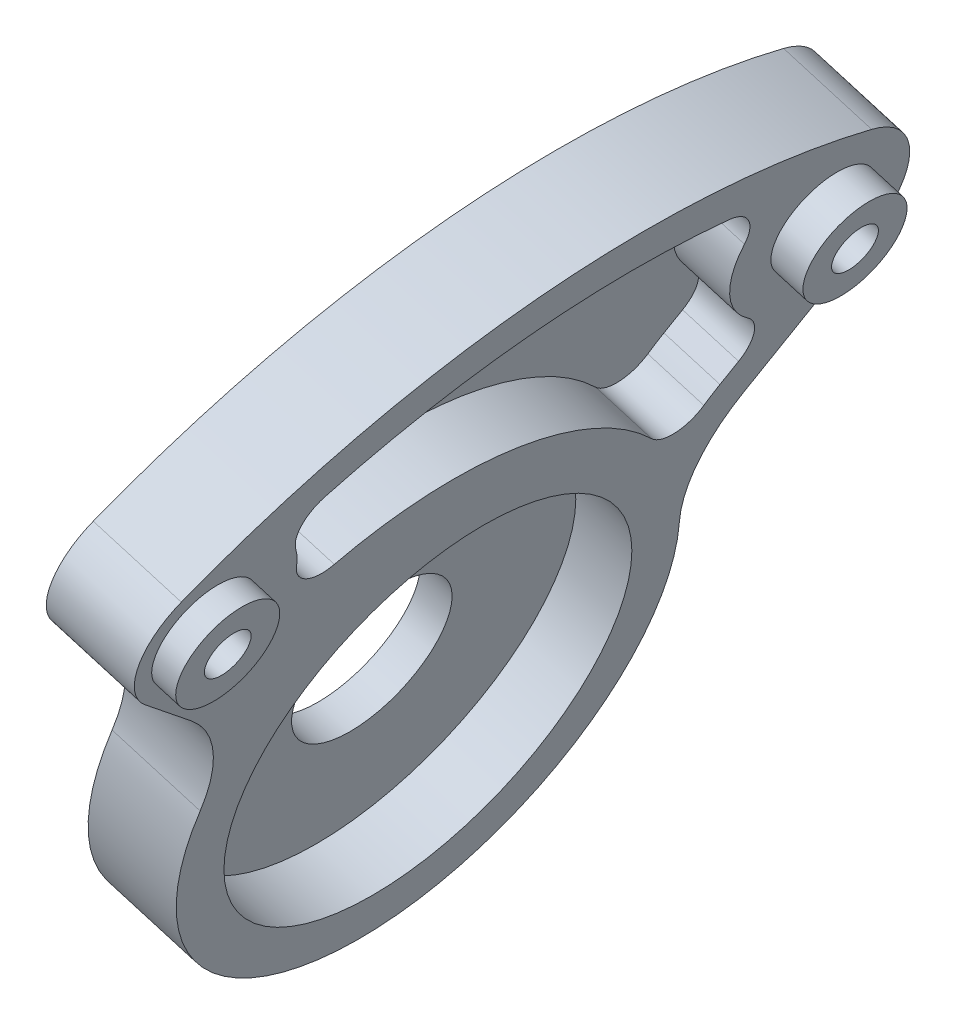
ISO-10303-21;
HEADER;
FILE_DESCRIPTION(('STEP AP214'),'2;1');
FILE_NAME('part.step','',(''),(''),'','','');
FILE_SCHEMA(('AUTOMOTIVE_DESIGN { 1 0 10303 214 1 1 1 1 }'));
ENDSEC;
DATA;
#1=APPLICATION_CONTEXT('core data for automotive mechanical design processes');
#2=APPLICATION_PROTOCOL_DEFINITION('international standard','automotive_design',2000,#1);
#3=PRODUCT_CONTEXT('',#1,'mechanical');
#4=PRODUCT('Part','Part','',(#3));
#5=PRODUCT_RELATED_PRODUCT_CATEGORY('part','',(#4));
#6=PRODUCT_DEFINITION_FORMATION('','',#4);
#7=PRODUCT_DEFINITION_CONTEXT('part definition',#1,'design');
#8=PRODUCT_DEFINITION('design','',#6,#7);
#9=PRODUCT_DEFINITION_SHAPE('','',#8);
#10=(LENGTH_UNIT() NAMED_UNIT(*) SI_UNIT(.MILLI.,.METRE.));
#11=(NAMED_UNIT(*) PLANE_ANGLE_UNIT() SI_UNIT($,.RADIAN.));
#12=(NAMED_UNIT(*) SI_UNIT($,.STERADIAN.) SOLID_ANGLE_UNIT());
#13=UNCERTAINTY_MEASURE_WITH_UNIT(LENGTH_MEASURE(1.E-05),#10,'distance_accuracy_value','');
#14=(GEOMETRIC_REPRESENTATION_CONTEXT(3) GLOBAL_UNCERTAINTY_ASSIGNED_CONTEXT((#13)) GLOBAL_UNIT_ASSIGNED_CONTEXT((#10,
#11,#12)) REPRESENTATION_CONTEXT('',''));
#15=CARTESIAN_POINT('',(0.,0.,0.));
#16=DIRECTION('',(0.,0.,1.));
#17=DIRECTION('',(1.,0.,0.));
#18=AXIS2_PLACEMENT_3D('',#15,#16,#17);
#19=CARTESIAN_POINT('',(75.6929175466582,-3.76179656158974,66.7343959904241));
#20=DIRECTION('',(0.958965274023996,-0.283523549667541,0.));
#21=DIRECTION('',(0.283523549667541,0.958965274023996,0.));
#22=AXIS2_PLACEMENT_3D('',#19,#20,#21);
#23=PLANE('',#22);
#24=CARTESIAN_POINT('',(75.6929175466582,-3.76179656158974,66.7343959904241));
#25=DIRECTION('',(0.958965274023996,-0.283523549667541,0.));
#26=DIRECTION('',(0.283523549667541,0.958965274023996,0.));
#27=AXIS2_PLACEMENT_3D('',#24,#25,#26);
#28=CIRCLE('',#27,8.00000000000008);
#29=CARTESIAN_POINT('',(77.199374063639,1.33351029495058,72.7150679259294));
#30=VERTEX_POINT('',#29);
#31=CARTESIAN_POINT('',(75.1793258350481,-5.49892427827565,74.5266107493798));
#32=VERTEX_POINT('',#31);
#33=EDGE_CURVE('E168',#30,#32,#28,.T.);
#34=ORIENTED_EDGE('',*,*,#33,.F.);
#35=DIRECTION('',(-0.211957667068936,-0.716907087684927,0.664167279379081));
#36=VECTOR('',#35,1.);
#37=CARTESIAN_POINT('',(79.029762545503,7.52445631738643,66.9795634970611));
#38=LINE('',#37,#36);
#39=CARTESIAN_POINT('',(79.029762545503,7.52445631738643,66.9795634970611));
#40=VERTEX_POINT('',#39);
#41=EDGE_CURVE('E137',#40,#30,#38,.T.);
#42=ORIENTED_EDGE('',*,*,#41,.F.);
#43=CARTESIAN_POINT('',(79.971297868616,10.7090231027241,70.7174834567519));
#44=DIRECTION('',(-0.958965274023996,0.283523549667541,0.));
#45=DIRECTION('',(-0.283523549667541,-0.958965274023996,0.));
#46=AXIS2_PLACEMENT_3D('',#43,#44,#45);
#47=CIRCLE('',#46,4.99999999999999);
#48=CARTESIAN_POINT('',(81.3171442144415,15.2610961539119,69.1467102235709));
#49=VERTEX_POINT('',#48);
#50=EDGE_CURVE('E121',#49,#40,#47,.T.);
#51=ORIENTED_EDGE('',*,*,#50,.F.);
#52=CARTESIAN_POINT('',(69.2045271020122,-25.7075613067784,83.2836693221998));
#53=DIRECTION('',(-0.958965274023996,0.283523549667541,0.));
#54=DIRECTION('',(-0.283523549667541,-0.958965274023996,0.));
#55=AXIS2_PLACEMENT_3D('',#52,#53,#54);
#56=CIRCLE('',#55,45.);
#57=CARTESIAN_POINT('',(79.7008136581295,9.79416094988889,108.866000829362));
#58=VERTEX_POINT('',#57);
#59=EDGE_CURVE('E135',#58,#49,#56,.T.);
#60=ORIENTED_EDGE('',*,*,#59,.F.);
#61=CARTESIAN_POINT('',(78.7678104086969,6.6384523048518,106.592015806503));
#62=DIRECTION('',(-0.958965274023996,0.283523549667541,0.));
#63=DIRECTION('',(-0.283523549667541,-0.958965274023996,0.));
#64=AXIS2_PLACEMENT_3D('',#61,#62,#63);
#65=CIRCLE('',#64,4.00000000000001);
#66=CARTESIAN_POINT('',(77.9199797404211,3.77082395411209,109.248684924019));
#67=VERTEX_POINT('',#66);
#68=EDGE_CURVE('E140',#67,#58,#65,.T.);
#69=ORIENTED_EDGE('',*,*,#68,.F.);
#70=DIRECTION('',(0.188307064622591,0.636913357067531,0.747583991938157));
#71=VECTOR('',#70,1.);
#72=CARTESIAN_POINT('',(76.9846333757962,0.607190161040417,105.535335292062));
#73=LINE('',#72,#71);
#74=CARTESIAN_POINT('',(76.9846333757962,0.607190161040417,105.535335292062));
#75=VERTEX_POINT('',#74);
#76=EDGE_CURVE('E142',#75,#67,#73,.T.);
#77=ORIENTED_EDGE('',*,*,#76,.F.);
#78=CARTESIAN_POINT('',(75.2889720392447,-5.128066540439,110.848673527095));
#79=DIRECTION('',(0.958965274023996,-0.283523549667541,0.));
#80=DIRECTION('',(0.283523549667541,0.958965274023996,0.));
#81=AXIS2_PLACEMENT_3D('',#78,#79,#80);
#82=CIRCLE('',#81,8.00000000000002);
#83=CARTESIAN_POINT('',(74.9190053969372,-6.37940937575634,102.955811828568));
#84=VERTEX_POINT('',#83);
#85=EDGE_CURVE('E213',#84,#75,#82,.T.);
#86=ORIENTED_EDGE('',*,*,#85,.F.);
#87=CARTESIAN_POINT('',(74.2484408577547,-8.64746826476899,88.649999999987));
#88=DIRECTION('',(-0.958965274023996,0.283523549667541,0.));
#89=DIRECTION('',(-0.283523549667541,-0.958965274023996,0.));
#90=AXIS2_PLACEMENT_3D('',#87,#88,#89);
#91=CIRCLE('',#90,14.5);
#92=EDGE_CURVE('E211',#32,#84,#91,.T.);
#93=ORIENTED_EDGE('',*,*,#92,.F.);
#94=EDGE_LOOP('',(#34,#42,#51,#60,#69,#77,#86,#93));
#95=FACE_BOUND('',#94,.T.);
#96=CARTESIAN_POINT('',(78.7678104086969,6.63845230485179,106.592015806503));
#97=DIRECTION('',(0.958965274023996,-0.283523549667541,0.));
#98=DIRECTION('',(0.283523549667541,0.958965274023996,0.));
#99=AXIS2_PLACEMENT_3D('',#96,#97,#98);
#100=CIRCLE('',#99,3.);
#101=CARTESIAN_POINT('',(79.6183810576995,9.51534812692378,106.592015806503));
#102=VERTEX_POINT('',#101);
#103=EDGE_CURVE('E181',#102,#102,#100,.T.);
#104=ORIENTED_EDGE('',*,*,#103,.F.);
#105=EDGE_LOOP('',(#104));
#106=FACE_BOUND('',#105,.T.);
#107=CARTESIAN_POINT('',(79.971297868616,10.7090231027241,70.7174834567519));
#108=DIRECTION('',(0.958965274023996,-0.283523549667541,0.));
#109=DIRECTION('',(0.283523549667541,0.958965274023996,0.));
#110=AXIS2_PLACEMENT_3D('',#107,#108,#109);
#111=CIRCLE('',#110,3.);
#112=CARTESIAN_POINT('',(80.8218685176187,13.5859189247961,70.7174834567519));
#113=VERTEX_POINT('',#112);
#114=EDGE_CURVE('E185',#113,#113,#111,.T.);
#115=ORIENTED_EDGE('',*,*,#114,.F.);
#116=EDGE_LOOP('',(#115));
#117=FACE_BOUND('',#116,.T.);
#118=CARTESIAN_POINT('',(74.2484408577547,-8.64746826476899,88.649999999987));
#119=DIRECTION('',(0.958965274023996,-0.283523549667541,0.));
#120=DIRECTION('',(-0.283523549667541,-0.958965274023996,0.));
#121=AXIS2_PLACEMENT_3D('',#118,#119,#120);
#122=CIRCLE('',#121,11.75);
#123=CARTESIAN_POINT('',(70.9170391491611,-19.915310234551,88.649999999987));
#124=VERTEX_POINT('',#123);
#125=EDGE_CURVE('E198',#124,#124,#122,.T.);
#126=ORIENTED_EDGE('',*,*,#125,.F.);
#127=EDGE_LOOP('',(#126));
#128=FACE_BOUND('',#127,.T.);
#129=CARTESIAN_POINT('',(78.3172039694346,5.11436046835069,75.2317493630277));
#130=DIRECTION('',(0.958965274023996,-0.283523549667541,0.));
#131=DIRECTION('',(0.283523549667541,0.958965274023996,0.));
#132=AXIS2_PLACEMENT_3D('',#129,#130,#131);
#133=CIRCLE('',#132,1.99999999999999);
#134=CARTESIAN_POINT('',(77.9405898401894,3.84053375421562,73.7365813791514));
#135=VERTEX_POINT('',#134);
#136=CARTESIAN_POINT('',(78.7656718502259,6.63121903159269,74.007814455029));
#137=VERTEX_POINT('',#136);
#138=EDGE_CURVE('E52',#135,#137,#133,.T.);
#139=ORIENTED_EDGE('',*,*,#138,.F.);
#140=DIRECTION('',(0.211957667068941,0.716907087684925,-0.664167279379082));
#141=VECTOR('',#140,1.);
#142=CARTESIAN_POINT('',(77.6701417251955,2.92579368761941,74.5840279057748));
#143=LINE('',#142,#141);
#144=CARTESIAN_POINT('',(77.6701417251955,2.92579368761941,74.5840279057748));
#145=VERTEX_POINT('',#144);
#146=EDGE_CURVE('E353',#145,#135,#143,.T.);
#147=ORIENTED_EDGE('',*,*,#146,.F.);
#148=CARTESIAN_POINT('',(75.6929175466583,-3.76179656158974,66.7343959904241));
#149=DIRECTION('',(-0.958965274023996,0.283523549667541,0.));
#150=DIRECTION('',(-0.283523549667541,-0.958965274023996,0.));
#151=AXIS2_PLACEMENT_3D('',#148,#149,#150);
#152=CIRCLE('',#151,10.5000000000001);
#153=CARTESIAN_POINT('',(77.417112676643,2.06997034890336,75.2940481945394));
#154=VERTEX_POINT('',#153);
#155=EDGE_CURVE('E358',#154,#145,#152,.T.);
#156=ORIENTED_EDGE('',*,*,#155,.F.);
#157=CARTESIAN_POINT('',(77.7455307966402,3.18078309375919,76.9244581381804));
#158=DIRECTION('',(0.958965274023996,-0.283523549667541,0.));
#159=DIRECTION('',(0.283523549667541,0.958965274023996,0.));
#160=AXIS2_PLACEMENT_3D('',#157,#158,#159);
#161=CIRCLE('',#160,1.99999999999999);
#162=CARTESIAN_POINT('',(77.3494180631229,1.84100600474078,78.3555738057932));
#163=VERTEX_POINT('',#162);
#164=EDGE_CURVE('E406',#163,#154,#161,.T.);
#165=ORIENTED_EDGE('',*,*,#164,.F.);
#166=CARTESIAN_POINT('',(73.6204996765611,-10.7713616330637,91.8277827874967));
#167=DIRECTION('',(-0.958965274023996,0.283523549667541,0.));
#168=DIRECTION('',(-0.283523549667541,-0.958965274023996,0.));
#169=AXIS2_PLACEMENT_3D('',#166,#167,#168);
#170=CIRCLE('',#169,18.8275613028207);
#171=CARTESIAN_POINT('',(78.6005667138149,6.07278184862573,98.6064867406273));
#172=VERTEX_POINT('',#171);
#173=EDGE_CURVE('E403',#172,#163,#170,.T.);
#174=ORIENTED_EDGE('',*,*,#173,.F.);
#175=CARTESIAN_POINT('',(79.1295855237558,7.8620888343548,99.3265697980242));
#176=DIRECTION('',(0.958965274023996,-0.283523549667541,0.));
#177=DIRECTION('',(0.283523549667541,0.958965274023996,0.));
#178=AXIS2_PLACEMENT_3D('',#175,#176,#177);
#179=CIRCLE('',#178,2.00000000000001);
#180=CARTESIAN_POINT('',(79.0314988799119,7.53032914313254,101.29642119282));
#181=VERTEX_POINT('',#180);
#182=EDGE_CURVE('E400',#181,#172,#179,.T.);
#183=ORIENTED_EDGE('',*,*,#182,.F.);
#184=CARTESIAN_POINT('',(78.7678104086969,6.63845230485179,106.592015806503));
#185=DIRECTION('',(-0.958965274023996,0.283523549667541,0.));
#186=DIRECTION('',(-0.283523549667541,-0.958965274023996,0.));
#187=AXIS2_PLACEMENT_3D('',#184,#185,#186);
#188=CIRCLE('',#187,5.37664376883742);
#189=CARTESIAN_POINT('',(79.4263314403908,8.86577628675523,101.742925567351));
#190=VERTEX_POINT('',#189);
#191=EDGE_CURVE('E397',#190,#181,#188,.T.);
#192=ORIENTED_EDGE('',*,*,#191,.F.);
#193=CARTESIAN_POINT('',(79.6712876100782,9.6942946255795,99.9391645418372));
#194=DIRECTION('',(0.958965274023996,-0.283523549667541,0.));
#195=DIRECTION('',(0.283523549667541,0.958965274023996,0.));
#196=AXIS2_PLACEMENT_3D('',#193,#194,#195);
#197=CIRCLE('',#196,1.99999999999999);
#198=CARTESIAN_POINT('',(80.1881646722049,11.4425344247083,100.76165813293));
#199=VERTEX_POINT('',#198);
#200=EDGE_CURVE('E394',#199,#190,#197,.T.);
#201=ORIENTED_EDGE('',*,*,#200,.F.);
#202=CARTESIAN_POINT('',(69.2045271020122,-25.7075613067784,83.2836693221998));
#203=DIRECTION('',(0.958965274023996,-0.283523549667541,0.));
#204=DIRECTION('',(0.283523549667541,0.958965274023996,0.));
#205=AXIS2_PLACEMENT_3D('',#202,#203,#204);
#206=CIRCLE('',#205,42.5);
#207=CARTESIAN_POINT('',(81.1422645244086,14.6695983750844,77.5021988120903));
#208=VERTEX_POINT('',#207);
#209=EDGE_CURVE('E391',#208,#199,#206,.T.);
#210=ORIENTED_EDGE('',*,*,#209,.F.);
#211=CARTESIAN_POINT('',(80.5804886457076,12.7694967429967,77.774268012566));
#212=DIRECTION('',(0.958965274023996,-0.283523549667541,0.));
#213=DIRECTION('',(0.283523549667541,0.958965274023996,0.));
#214=AXIS2_PLACEMENT_3D('',#211,#212,#213);
#215=CIRCLE('',#214,2.00000000000001);
#216=CARTESIAN_POINT('',(80.4153211803448,12.2108487440309,75.8609901650914));
#217=VERTEX_POINT('',#216);
#218=EDGE_CURVE('E388',#217,#208,#215,.T.);
#219=ORIENTED_EDGE('',*,*,#218,.F.);
#220=CARTESIAN_POINT('',(79.971297868616,10.7090231027241,70.7174834567519));
#221=DIRECTION('',(-0.958965274023996,0.283523549667541,0.));
#222=DIRECTION('',(-0.283523549667541,-0.958965274023996,0.));
#223=AXIS2_PLACEMENT_3D('',#220,#221,#222);
#224=CIRCLE('',#223,5.37664376883742);
#225=EDGE_CURVE('E385',#137,#217,#224,.T.);
#226=ORIENTED_EDGE('',*,*,#225,.F.);
#227=EDGE_LOOP('',(#139,#147,#156,#165,#174,#183,#192,#201,#210,#219,#226));
#228=FACE_BOUND('',#227,.T.);
#229=ADVANCED_FACE('F35',(#95,#106,#117,#128,#228),#23,.T.);
#230=CARTESIAN_POINT('',(75.6929175466582,-3.76179656158974,66.7343959904241));
#231=DIRECTION('',(-0.958965274023996,0.283523549667541,0.));
#232=DIRECTION('',(-0.283523549667541,-0.958965274023996,0.));
#233=AXIS2_PLACEMENT_3D('',#230,#231,#232);
#234=CYLINDRICAL_SURFACE('',#233,8.00000000000008);
#235=CARTESIAN_POINT('',(70.4186085395262,-2.20241703841827,66.7343959904241));
#236=DIRECTION('',(0.958965274023996,-0.283523549667541,0.));
#237=DIRECTION('',(0.283523549667541,0.958965274023996,0.));
#238=AXIS2_PLACEMENT_3D('',#235,#236,#237);
#239=CIRCLE('',#238,8.00000000000008);
#240=CARTESIAN_POINT('',(71.925065056507,2.89288981812206,72.7150679259294));
#241=VERTEX_POINT('',#240);
#242=CARTESIAN_POINT('',(69.9050168279161,-3.93954475510417,74.5266107493798));
#243=VERTEX_POINT('',#242);
#244=EDGE_CURVE('E147',#241,#243,#239,.T.);
#245=ORIENTED_EDGE('',*,*,#244,.F.);
#246=DIRECTION('',(-0.958965274023996,0.283523549667541,0.));
#247=VECTOR('',#246,1.);
#248=CARTESIAN_POINT('',(77.199374063639,1.33351029495058,72.7150679259294));
#249=LINE('',#248,#247);
#250=EDGE_CURVE('E11',#30,#241,#249,.T.);
#251=ORIENTED_EDGE('',*,*,#250,.F.);
#252=ORIENTED_EDGE('',*,*,#33,.T.);
#253=DIRECTION('',(-0.958965274023996,0.283523549667541,0.));
#254=VECTOR('',#253,1.);
#255=CARTESIAN_POINT('',(75.1793258350481,-5.49892427827565,74.5266107493798));
#256=LINE('',#255,#254);
#257=EDGE_CURVE('E98',#32,#243,#256,.T.);
#258=ORIENTED_EDGE('',*,*,#257,.T.);
#259=EDGE_LOOP('',(#245,#251,#252,#258));
#260=FACE_BOUND('',#259,.T.);
#261=ADVANCED_FACE('F37',(#260),#234,.F.);
#262=CARTESIAN_POINT('',(79.029762545503,7.52445631738643,66.9795634970611));
#263=DIRECTION('',(-0.18830706462259,-0.636913357067532,-0.747583991938157));
#264=DIRECTION('',(0.,0.761201737041522,-0.648515162139613));
#265=AXIS2_PLACEMENT_3D('',#262,#263,#264);
#266=PLANE('',#265);
#267=DIRECTION('',(-0.211957667068936,-0.716907087684927,0.664167279379081));
#268=VECTOR('',#267,1.);
#269=CARTESIAN_POINT('',(73.7554535383711,9.0838358405579,66.9795634970611));
#270=LINE('',#269,#268);
#271=CARTESIAN_POINT('',(73.7554535383711,9.0838358405579,66.9795634970611));
#272=VERTEX_POINT('',#271);
#273=EDGE_CURVE('E166',#272,#241,#270,.T.);
#274=ORIENTED_EDGE('',*,*,#273,.F.);
#275=DIRECTION('',(-0.958965274023996,0.283523549667541,0.));
#276=VECTOR('',#275,1.);
#277=CARTESIAN_POINT('',(79.029762545503,7.52445631738643,66.9795634970611));
#278=LINE('',#277,#276);
#279=EDGE_CURVE('E44',#40,#272,#278,.T.);
#280=ORIENTED_EDGE('',*,*,#279,.F.);
#281=ORIENTED_EDGE('',*,*,#41,.T.);
#282=ORIENTED_EDGE('',*,*,#250,.T.);
#283=EDGE_LOOP('',(#274,#280,#281,#282));
#284=FACE_BOUND('',#283,.T.);
#285=ADVANCED_FACE('F228',(#284),#266,.T.);
#286=CARTESIAN_POINT('',(79.971297868616,10.7090231027241,70.7174834567519));
#287=DIRECTION('',(-0.958965274023996,0.283523549667541,0.));
#288=DIRECTION('',(-0.283523549667541,-0.958965274023996,0.));
#289=AXIS2_PLACEMENT_3D('',#286,#287,#288);
#290=CYLINDRICAL_SURFACE('',#289,4.99999999999999);
#291=CARTESIAN_POINT('',(74.696988861484,12.2684026258956,70.7174834567519));
#292=DIRECTION('',(-0.958965274023996,0.283523549667541,0.));
#293=DIRECTION('',(-0.283523549667541,-0.958965274023996,0.));
#294=AXIS2_PLACEMENT_3D('',#291,#292,#293);
#295=CIRCLE('',#294,4.99999999999999);
#296=CARTESIAN_POINT('',(76.0428352073095,16.8204756770834,69.1467102235709));
#297=VERTEX_POINT('',#296);
#298=EDGE_CURVE('E124',#297,#272,#295,.T.);
#299=ORIENTED_EDGE('',*,*,#298,.F.);
#300=DIRECTION('',(-0.958965274023996,0.283523549667541,0.));
#301=VECTOR('',#300,1.);
#302=CARTESIAN_POINT('',(81.3171442144415,15.2610961539119,69.1467102235709));
#303=LINE('',#302,#301);
#304=EDGE_CURVE('E118',#49,#297,#303,.T.);
#305=ORIENTED_EDGE('',*,*,#304,.F.);
#306=ORIENTED_EDGE('',*,*,#50,.T.);
#307=ORIENTED_EDGE('',*,*,#279,.T.);
#308=EDGE_LOOP('',(#299,#305,#306,#307));
#309=FACE_BOUND('',#308,.T.);
#310=ADVANCED_FACE('F120',(#309),#290,.T.);
#311=CARTESIAN_POINT('',(69.2045271020122,-25.7075613067784,83.2836693221998));
#312=DIRECTION('',(-0.958965274023996,0.283523549667541,0.));
#313=DIRECTION('',(-0.283523549667541,-0.958965274023996,0.));
#314=AXIS2_PLACEMENT_3D('',#311,#312,#313);
#315=CYLINDRICAL_SURFACE('',#314,45.);
#316=CARTESIAN_POINT('',(63.9302180948802,-24.1481817836069,83.2836693221998));
#317=DIRECTION('',(-0.958965274023996,0.283523549667541,0.));
#318=DIRECTION('',(-0.283523549667541,-0.958965274023996,0.));
#319=AXIS2_PLACEMENT_3D('',#316,#317,#318);
#320=CIRCLE('',#319,45.);
#321=CARTESIAN_POINT('',(74.4265046509975,11.3535404730604,108.866000829362));
#322=VERTEX_POINT('',#321);
#323=EDGE_CURVE('E163',#322,#297,#320,.T.);
#324=ORIENTED_EDGE('',*,*,#323,.F.);
#325=DIRECTION('',(-0.958965274023996,0.283523549667541,0.));
#326=VECTOR('',#325,1.);
#327=CARTESIAN_POINT('',(79.7008136581295,9.79416094988889,108.866000829362));
#328=LINE('',#327,#326);
#329=EDGE_CURVE('E129',#58,#322,#328,.T.);
#330=ORIENTED_EDGE('',*,*,#329,.F.);
#331=ORIENTED_EDGE('',*,*,#59,.T.);
#332=ORIENTED_EDGE('',*,*,#304,.T.);
#333=EDGE_LOOP('',(#324,#330,#331,#332));
#334=FACE_BOUND('',#333,.T.);
#335=ADVANCED_FACE('F139',(#334),#315,.T.);
#336=CARTESIAN_POINT('',(78.7678104086969,6.6384523048518,106.592015806503));
#337=DIRECTION('',(-0.958965274023996,0.283523549667541,0.));
#338=DIRECTION('',(-0.283523549667541,-0.958965274023996,0.));
#339=AXIS2_PLACEMENT_3D('',#336,#337,#338);
#340=CYLINDRICAL_SURFACE('',#339,4.00000000000001);
#341=CARTESIAN_POINT('',(73.4935014015649,8.19783182802327,106.592015806503));
#342=DIRECTION('',(-0.958965274023996,0.283523549667541,0.));
#343=DIRECTION('',(-0.283523549667541,-0.958965274023996,0.));
#344=AXIS2_PLACEMENT_3D('',#341,#342,#343);
#345=CIRCLE('',#344,4.00000000000001);
#346=CARTESIAN_POINT('',(72.6456707332891,5.33020347728356,109.248684924019));
#347=VERTEX_POINT('',#346);
#348=EDGE_CURVE('E160',#347,#322,#345,.T.);
#349=ORIENTED_EDGE('',*,*,#348,.F.);
#350=DIRECTION('',(-0.958965274023996,0.283523549667541,0.));
#351=VECTOR('',#350,1.);
#352=CARTESIAN_POINT('',(77.9199797404211,3.77082395411209,109.248684924019));
#353=LINE('',#352,#351);
#354=EDGE_CURVE('E172',#67,#347,#353,.T.);
#355=ORIENTED_EDGE('',*,*,#354,.F.);
#356=ORIENTED_EDGE('',*,*,#68,.T.);
#357=ORIENTED_EDGE('',*,*,#329,.T.);
#358=EDGE_LOOP('',(#349,#355,#356,#357));
#359=FACE_BOUND('',#358,.T.);
#360=ADVANCED_FACE('F622',(#359),#340,.T.);
#361=CARTESIAN_POINT('',(76.9846333757962,0.607190161040417,105.535335292062));
#362=DIRECTION('',(-0.211957667068937,-0.716907087684928,0.66416727937908));
#363=DIRECTION('',(0.,-0.679608773403677,-0.733574750869159));
#364=AXIS2_PLACEMENT_3D('',#361,#362,#363);
#365=PLANE('',#364);
#366=DIRECTION('',(0.188307064622591,0.636913357067531,0.747583991938157));
#367=VECTOR('',#366,1.);
#368=CARTESIAN_POINT('',(71.7103243686642,2.16656968421189,105.535335292062));
#369=LINE('',#368,#367);
#370=CARTESIAN_POINT('',(71.7103243686642,2.16656968421189,105.535335292062));
#371=VERTEX_POINT('',#370);
#372=EDGE_CURVE('E157',#371,#347,#369,.T.);
#373=ORIENTED_EDGE('',*,*,#372,.F.);
#374=DIRECTION('',(-0.958965274023996,0.283523549667541,0.));
#375=VECTOR('',#374,1.);
#376=CARTESIAN_POINT('',(76.9846333757962,0.607190161040417,105.535335292062));
#377=LINE('',#376,#375);
#378=EDGE_CURVE('E174',#75,#371,#377,.T.);
#379=ORIENTED_EDGE('',*,*,#378,.F.);
#380=ORIENTED_EDGE('',*,*,#76,.T.);
#381=ORIENTED_EDGE('',*,*,#354,.T.);
#382=EDGE_LOOP('',(#373,#379,#380,#381));
#383=FACE_BOUND('',#382,.T.);
#384=ADVANCED_FACE('F219',(#383),#365,.T.);
#385=CARTESIAN_POINT('',(75.2889720392447,-5.128066540439,110.848673527095));
#386=DIRECTION('',(-0.958965274023996,0.283523549667541,0.));
#387=DIRECTION('',(-0.283523549667541,-0.958965274023996,0.));
#388=AXIS2_PLACEMENT_3D('',#385,#386,#387);
#389=CYLINDRICAL_SURFACE('',#388,8.00000000000002);
#390=CARTESIAN_POINT('',(70.0146630321128,-3.56868701726753,110.848673527095));
#391=DIRECTION('',(0.958965274023996,-0.283523549667541,0.));
#392=DIRECTION('',(0.283523549667541,0.958965274023996,0.));
#393=AXIS2_PLACEMENT_3D('',#390,#391,#392);
#394=CIRCLE('',#393,8.00000000000002);
#395=CARTESIAN_POINT('',(69.6446963898052,-4.82002985258487,102.955811828568));
#396=VERTEX_POINT('',#395);
#397=EDGE_CURVE('E154',#396,#371,#394,.T.);
#398=ORIENTED_EDGE('',*,*,#397,.F.);
#399=DIRECTION('',(-0.958965274023996,0.283523549667541,0.));
#400=VECTOR('',#399,1.);
#401=CARTESIAN_POINT('',(74.9190053969372,-6.37940937575634,102.955811828568));
#402=LINE('',#401,#400);
#403=EDGE_CURVE('E176',#84,#396,#402,.T.);
#404=ORIENTED_EDGE('',*,*,#403,.F.);
#405=ORIENTED_EDGE('',*,*,#85,.T.);
#406=ORIENTED_EDGE('',*,*,#378,.T.);
#407=EDGE_LOOP('',(#398,#404,#405,#406));
#408=FACE_BOUND('',#407,.T.);
#409=ADVANCED_FACE('F224',(#408),#389,.F.);
#410=CARTESIAN_POINT('',(74.2484408577547,-8.64746826476899,88.649999999987));
#411=DIRECTION('',(-0.958965274023996,0.283523549667541,0.));
#412=DIRECTION('',(-0.283523549667541,-0.958965274023996,0.));
#413=AXIS2_PLACEMENT_3D('',#410,#411,#412);
#414=CYLINDRICAL_SURFACE('',#413,14.5);
#415=CARTESIAN_POINT('',(68.9741318506227,-7.08808874159752,88.649999999987));
#416=DIRECTION('',(-0.958965274023996,0.283523549667541,0.));
#417=DIRECTION('',(-0.283523549667541,-0.958965274023996,0.));
#418=AXIS2_PLACEMENT_3D('',#415,#416,#417);
#419=CIRCLE('',#418,14.5);
#420=EDGE_CURVE('E150',#243,#396,#419,.T.);
#421=ORIENTED_EDGE('',*,*,#420,.F.);
#422=ORIENTED_EDGE('',*,*,#257,.F.);
#423=ORIENTED_EDGE('',*,*,#92,.T.);
#424=ORIENTED_EDGE('',*,*,#403,.T.);
#425=EDGE_LOOP('',(#421,#422,#423,#424));
#426=FACE_BOUND('',#425,.T.);
#427=ADVANCED_FACE('F225',(#426),#414,.T.);
#428=CARTESIAN_POINT('',(70.4186085395262,-2.20241703841827,66.7343959904241));
#429=DIRECTION('',(0.958965274023996,-0.283523549667541,0.));
#430=DIRECTION('',(0.283523549667541,0.958965274023996,0.));
#431=AXIS2_PLACEMENT_3D('',#428,#429,#430);
#432=PLANE('',#431);
#433=CARTESIAN_POINT('',(68.9741318506227,-7.08808874159752,88.649999999987));
#434=DIRECTION('',(-0.958965274023996,0.283523549667541,0.));
#435=DIRECTION('',(0.283523549667541,0.958965274023996,0.));
#436=AXIS2_PLACEMENT_3D('',#433,#434,#435);
#437=CIRCLE('',#436,4.625);
#438=CARTESIAN_POINT('',(70.2854282678351,-2.65287434923654,88.649999999987));
#439=VERTEX_POINT('',#438);
#440=EDGE_CURVE('E255',#439,#439,#437,.T.);
#441=ORIENTED_EDGE('',*,*,#440,.F.);
#442=EDGE_LOOP('',(#441));
#443=FACE_BOUND('',#442,.T.);
#444=CARTESIAN_POINT('',(74.696988861484,12.2684026258956,70.7174834567519));
#445=DIRECTION('',(-0.958965274023996,0.283523549667541,0.));
#446=DIRECTION('',(0.283523549667541,0.958965274023996,0.));
#447=AXIS2_PLACEMENT_3D('',#444,#445,#446);
#448=CIRCLE('',#447,1.35);
#449=CARTESIAN_POINT('',(75.0797456535352,13.563005745828,70.7174834567519));
#450=VERTEX_POINT('',#449);
#451=EDGE_CURVE('E186',#450,#450,#448,.T.);
#452=ORIENTED_EDGE('',*,*,#451,.F.);
#453=EDGE_LOOP('',(#452));
#454=FACE_BOUND('',#453,.T.);
#455=CARTESIAN_POINT('',(73.4935014015649,8.19783182802327,106.592015806503));
#456=DIRECTION('',(-0.958965274023996,0.283523549667541,0.));
#457=DIRECTION('',(0.283523549667541,0.958965274023996,0.));
#458=AXIS2_PLACEMENT_3D('',#455,#456,#457);
#459=CIRCLE('',#458,1.35);
#460=CARTESIAN_POINT('',(73.8762581936161,9.49243494795566,106.592015806503));
#461=VERTEX_POINT('',#460);
#462=EDGE_CURVE('E182',#461,#461,#459,.T.);
#463=ORIENTED_EDGE('',*,*,#462,.F.);
#464=EDGE_LOOP('',(#463));
#465=FACE_BOUND('',#464,.T.);
#466=ORIENTED_EDGE('',*,*,#244,.T.);
#467=ORIENTED_EDGE('',*,*,#420,.T.);
#468=ORIENTED_EDGE('',*,*,#397,.T.);
#469=ORIENTED_EDGE('',*,*,#372,.T.);
#470=ORIENTED_EDGE('',*,*,#348,.T.);
#471=ORIENTED_EDGE('',*,*,#323,.T.);
#472=ORIENTED_EDGE('',*,*,#298,.T.);
#473=ORIENTED_EDGE('',*,*,#273,.T.);
#474=EDGE_LOOP('',(#466,#467,#468,#469,#470,#471,#472,#473));
#475=FACE_BOUND('',#474,.T.);
#476=ADVANCED_FACE('F227',(#443,#454,#465,#475),#432,.F.);
#477=CARTESIAN_POINT('',(80.2062583197329,6.21316698035048,106.592015806503));
#478=DIRECTION('',(-0.958965274023996,0.283523549667541,0.));
#479=DIRECTION('',(-0.283523549667541,-0.958965274023996,0.));
#480=AXIS2_PLACEMENT_3D('',#477,#478,#479);
#481=CYLINDRICAL_SURFACE('',#480,3.);
#482=CARTESIAN_POINT('',(80.2062583197329,6.21316698035048,106.592015806503));
#483=DIRECTION('',(0.958965274023996,-0.283523549667541,0.));
#484=DIRECTION('',(0.283523549667541,0.958965274023996,0.));
#485=AXIS2_PLACEMENT_3D('',#482,#483,#484);
#486=CIRCLE('',#485,3.);
#487=CARTESIAN_POINT('',(81.0568289687355,9.09006280242247,106.592015806503));
#488=VERTEX_POINT('',#487);
#489=EDGE_CURVE('E151',#488,#488,#486,.T.);
#490=ORIENTED_EDGE('',*,*,#489,.F.);
#491=EDGE_LOOP('',(#490));
#492=FACE_BOUND('',#491,.T.);
#493=ORIENTED_EDGE('',*,*,#103,.T.);
#494=EDGE_LOOP('',(#493));
#495=FACE_BOUND('',#494,.T.);
#496=ADVANCED_FACE('F242',(#492,#495),#481,.T.);
#497=CARTESIAN_POINT('',(80.2062583197329,6.21316698035048,106.592015806503));
#498=DIRECTION('',(0.958965274023996,-0.283523549667541,0.));
#499=DIRECTION('',(0.283523549667541,0.958965274023996,0.));
#500=AXIS2_PLACEMENT_3D('',#497,#498,#499);
#501=PLANE('',#500);
#502=CARTESIAN_POINT('',(80.2062583197329,6.21316698035048,106.592015806503));
#503=DIRECTION('',(0.958965274023996,-0.283523549667541,0.));
#504=DIRECTION('',(0.283523549667541,0.958965274023996,0.));
#505=AXIS2_PLACEMENT_3D('',#502,#503,#504);
#506=CIRCLE('',#505,1.35);
#507=CARTESIAN_POINT('',(80.5890151117841,7.50777010028287,106.592015806503));
#508=VERTEX_POINT('',#507);
#509=EDGE_CURVE('E179',#508,#508,#506,.T.);
#510=ORIENTED_EDGE('',*,*,#509,.F.);
#511=EDGE_LOOP('',(#510));
#512=FACE_BOUND('',#511,.T.);
#513=ORIENTED_EDGE('',*,*,#489,.T.);
#514=EDGE_LOOP('',(#513));
#515=FACE_BOUND('',#514,.T.);
#516=ADVANCED_FACE('F250',(#512,#515),#501,.T.);
#517=CARTESIAN_POINT('',(89.6429288198219,3.42316155502238,106.592015806503));
#518=DIRECTION('',(-0.958965274023996,0.283523549667541,0.));
#519=DIRECTION('',(-0.283523549667541,-0.958965274023996,0.));
#520=AXIS2_PLACEMENT_3D('',#517,#518,#519);
#521=CYLINDRICAL_SURFACE('',#520,1.35);
#522=ORIENTED_EDGE('',*,*,#509,.T.);
#523=EDGE_LOOP('',(#522));
#524=FACE_BOUND('',#523,.T.);
#525=ORIENTED_EDGE('',*,*,#462,.T.);
#526=EDGE_LOOP('',(#525));
#527=FACE_BOUND('',#526,.T.);
#528=ADVANCED_FACE('F259',(#524,#527),#521,.F.);
#529=CARTESIAN_POINT('',(81.889228416664,10.141976003389,70.7174834567519));
#530=DIRECTION('',(-0.958965274023996,0.283523549667541,0.));
#531=DIRECTION('',(-0.283523549667541,-0.958965274023996,0.));
#532=AXIS2_PLACEMENT_3D('',#529,#530,#531);
#533=CYLINDRICAL_SURFACE('',#532,3.);
#534=CARTESIAN_POINT('',(81.889228416664,10.141976003389,70.7174834567519));
#535=DIRECTION('',(0.958965274023996,-0.283523549667541,0.));
#536=DIRECTION('',(0.283523549667541,0.958965274023996,0.));
#537=AXIS2_PLACEMENT_3D('',#534,#535,#536);
#538=CIRCLE('',#537,3.);
#539=CARTESIAN_POINT('',(82.7397990656666,13.018871825461,70.7174834567519));
#540=VERTEX_POINT('',#539);
#541=EDGE_CURVE('E190',#540,#540,#538,.T.);
#542=ORIENTED_EDGE('',*,*,#541,.F.);
#543=EDGE_LOOP('',(#542));
#544=FACE_BOUND('',#543,.T.);
#545=ORIENTED_EDGE('',*,*,#114,.T.);
#546=EDGE_LOOP('',(#545));
#547=FACE_BOUND('',#546,.T.);
#548=ADVANCED_FACE('F261',(#544,#547),#533,.T.);
#549=CARTESIAN_POINT('',(81.889228416664,10.141976003389,70.7174834567519));
#550=DIRECTION('',(0.958965274023996,-0.283523549667541,0.));
#551=DIRECTION('',(0.283523549667541,0.958965274023996,0.));
#552=AXIS2_PLACEMENT_3D('',#549,#550,#551);
#553=PLANE('',#552);
#554=CARTESIAN_POINT('',(81.889228416664,10.141976003389,70.7174834567519));
#555=DIRECTION('',(0.958965274023996,-0.283523549667541,0.));
#556=DIRECTION('',(0.283523549667541,0.958965274023996,0.));
#557=AXIS2_PLACEMENT_3D('',#554,#555,#556);
#558=CIRCLE('',#557,1.35);
#559=CARTESIAN_POINT('',(82.2719852087152,11.4365791233214,70.7174834567519));
#560=VERTEX_POINT('',#559);
#561=EDGE_CURVE('E183',#560,#560,#558,.T.);
#562=ORIENTED_EDGE('',*,*,#561,.F.);
#563=EDGE_LOOP('',(#562));
#564=FACE_BOUND('',#563,.T.);
#565=ORIENTED_EDGE('',*,*,#541,.T.);
#566=EDGE_LOOP('',(#565));
#567=FACE_BOUND('',#566,.T.);
#568=ADVANCED_FACE('F268',(#564,#567),#553,.T.);
#569=CARTESIAN_POINT('',(91.5606920273336,7.2825526565235,70.7174834567519));
#570=DIRECTION('',(-0.958965274023996,0.283523549667541,0.));
#571=DIRECTION('',(-0.283523549667541,-0.958965274023996,0.));
#572=AXIS2_PLACEMENT_3D('',#569,#570,#571);
#573=CYLINDRICAL_SURFACE('',#572,1.35);
#574=ORIENTED_EDGE('',*,*,#561,.T.);
#575=EDGE_LOOP('',(#574));
#576=FACE_BOUND('',#575,.T.);
#577=ORIENTED_EDGE('',*,*,#451,.T.);
#578=EDGE_LOOP('',(#577));
#579=FACE_BOUND('',#578,.T.);
#580=ADVANCED_FACE('F275',(#576,#579),#573,.F.);
#581=CARTESIAN_POINT('',(70.8920623986707,-7.6551358409326,88.649999999987));
#582=DIRECTION('',(0.958965274023996,-0.283523549667541,0.));
#583=DIRECTION('',(0.283523549667541,0.958965274023996,0.));
#584=AXIS2_PLACEMENT_3D('',#581,#582,#583);
#585=CYLINDRICAL_SURFACE('',#584,11.75);
#586=CARTESIAN_POINT('',(70.8920623986707,-7.6551358409326,88.649999999987));
#587=DIRECTION('',(0.958965274023996,-0.283523549667541,0.));
#588=DIRECTION('',(-0.283523549667541,-0.958965274023996,0.));
#589=AXIS2_PLACEMENT_3D('',#586,#587,#588);
#590=CIRCLE('',#589,11.75);
#591=CARTESIAN_POINT('',(67.5606606900771,-18.9229778107146,88.649999999987));
#592=VERTEX_POINT('',#591);
#593=EDGE_CURVE('E193',#592,#592,#590,.T.);
#594=ORIENTED_EDGE('',*,*,#593,.F.);
#595=EDGE_LOOP('',(#594));
#596=FACE_BOUND('',#595,.T.);
#597=ORIENTED_EDGE('',*,*,#125,.T.);
#598=EDGE_LOOP('',(#597));
#599=FACE_BOUND('',#598,.T.);
#600=ADVANCED_FACE('F279',(#596,#599),#585,.F.);
#601=CARTESIAN_POINT('',(70.8920623986707,-7.6551358409326,88.649999999987));
#602=DIRECTION('',(-0.958965274023996,0.283523549667541,0.));
#603=DIRECTION('',(-0.283523549667541,-0.958965274023996,0.));
#604=AXIS2_PLACEMENT_3D('',#601,#602,#603);
#605=PLANE('',#604);
#606=CARTESIAN_POINT('',(70.8920623986707,-7.6551358409326,88.649999999987));
#607=DIRECTION('',(-0.958965274023996,0.283523549667541,0.));
#608=DIRECTION('',(-0.283523549667541,-0.958965274023996,0.));
#609=AXIS2_PLACEMENT_3D('',#606,#607,#608);
#610=CIRCLE('',#609,4.625);
#611=CARTESIAN_POINT('',(69.5807659814584,-12.0903502332936,88.649999999987));
#612=VERTEX_POINT('',#611);
#613=EDGE_CURVE('E39',#612,#612,#610,.T.);
#614=ORIENTED_EDGE('',*,*,#613,.T.);
#615=EDGE_LOOP('',(#614));
#616=FACE_BOUND('',#615,.T.);
#617=ORIENTED_EDGE('',*,*,#593,.T.);
#618=EDGE_LOOP('',(#617));
#619=FACE_BOUND('',#618,.T.);
#620=ADVANCED_FACE('F282',(#616,#619),#605,.F.);
#621=CARTESIAN_POINT('',(85.8378350164723,-12.0739387109696,88.649999999987));
#622=DIRECTION('',(-0.958965274023996,0.283523549667541,0.));
#623=DIRECTION('',(-0.283523549667541,-0.958965274023996,0.));
#624=AXIS2_PLACEMENT_3D('',#621,#622,#623);
#625=CYLINDRICAL_SURFACE('',#624,4.625);
#626=ORIENTED_EDGE('',*,*,#440,.T.);
#627=EDGE_LOOP('',(#626));
#628=FACE_BOUND('',#627,.T.);
#629=ORIENTED_EDGE('',*,*,#613,.F.);
#630=EDGE_LOOP('',(#629));
#631=FACE_BOUND('',#630,.T.);
#632=ADVANCED_FACE('F286',(#628,#631),#625,.F.);
#633=CARTESIAN_POINT('',(74.9608255103506,6.10669289218708,75.2317493630277));
#634=DIRECTION('',(0.958965274023996,-0.283523549667541,0.));
#635=DIRECTION('',(0.283523549667541,0.958965274023996,0.));
#636=AXIS2_PLACEMENT_3D('',#633,#634,#635);
#637=CYLINDRICAL_SURFACE('',#636,1.99999999999999);
#638=ORIENTED_EDGE('',*,*,#138,.T.);
#639=DIRECTION('',(0.958965274023996,-0.283523549667541,0.));
#640=VECTOR('',#639,1.);
#641=CARTESIAN_POINT('',(75.4092933911419,7.62355145542908,74.007814455029));
#642=LINE('',#641,#640);
#643=CARTESIAN_POINT('',(75.4092933911419,7.62355145542908,74.007814455029));
#644=VERTEX_POINT('',#643);
#645=EDGE_CURVE('E383',#644,#137,#642,.T.);
#646=ORIENTED_EDGE('',*,*,#645,.F.);
#647=CARTESIAN_POINT('',(74.9608255103506,6.10669289218708,75.2317493630277));
#648=DIRECTION('',(0.958965274023996,-0.283523549667541,0.));
#649=DIRECTION('',(0.283523549667541,0.958965274023996,0.));
#650=AXIS2_PLACEMENT_3D('',#647,#648,#649);
#651=CIRCLE('',#650,1.99999999999999);
#652=CARTESIAN_POINT('',(74.5842113811055,4.83286617805201,73.7365813791514));
#653=VERTEX_POINT('',#652);
#654=EDGE_CURVE('E344',#653,#644,#651,.T.);
#655=ORIENTED_EDGE('',*,*,#654,.F.);
#656=DIRECTION('',(0.958965274023996,-0.283523549667541,0.));
#657=VECTOR('',#656,1.);
#658=CARTESIAN_POINT('',(74.5842113811055,4.83286617805201,73.7365813791514));
#659=LINE('',#658,#657);
#660=EDGE_CURVE('E411',#653,#135,#659,.T.);
#661=ORIENTED_EDGE('',*,*,#660,.T.);
#662=EDGE_LOOP('',(#638,#646,#655,#661));
#663=FACE_BOUND('',#662,.T.);
#664=ADVANCED_FACE('F290',(#663),#637,.F.);
#665=CARTESIAN_POINT('',(74.3137632661115,3.9181261114558,74.5840279057748));
#666=DIRECTION('',(-0.188307064622591,-0.636913357067533,-0.747583991938156));
#667=DIRECTION('',(0.,0.761201737041522,-0.648515162139614));
#668=AXIS2_PLACEMENT_3D('',#665,#666,#667);
#669=PLANE('',#668);
#670=ORIENTED_EDGE('',*,*,#146,.T.);
#671=ORIENTED_EDGE('',*,*,#660,.F.);
#672=DIRECTION('',(0.211957667068941,0.716907087684925,-0.664167279379082));
#673=VECTOR('',#672,1.);
#674=CARTESIAN_POINT('',(74.3137632661115,3.9181261114558,74.5840279057748));
#675=LINE('',#674,#673);
#676=CARTESIAN_POINT('',(74.3137632661115,3.9181261114558,74.5840279057748));
#677=VERTEX_POINT('',#676);
#678=EDGE_CURVE('E351',#677,#653,#675,.T.);
#679=ORIENTED_EDGE('',*,*,#678,.F.);
#680=DIRECTION('',(0.958965274023996,-0.283523549667541,0.));
#681=VECTOR('',#680,1.);
#682=CARTESIAN_POINT('',(74.3137632661115,3.9181261114558,74.5840279057748));
#683=LINE('',#682,#681);
#684=EDGE_CURVE('E413',#677,#145,#683,.T.);
#685=ORIENTED_EDGE('',*,*,#684,.T.);
#686=EDGE_LOOP('',(#670,#671,#679,#685));
#687=FACE_BOUND('',#686,.T.);
#688=ADVANCED_FACE('F294',(#687),#669,.F.);
#689=CARTESIAN_POINT('',(72.3365390875743,-2.76946413775335,66.7343959904241));
#690=DIRECTION('',(0.958965274023996,-0.283523549667541,0.));
#691=DIRECTION('',(0.283523549667541,0.958965274023996,0.));
#692=AXIS2_PLACEMENT_3D('',#689,#690,#691);
#693=CYLINDRICAL_SURFACE('',#692,10.5000000000001);
#694=ORIENTED_EDGE('',*,*,#155,.T.);
#695=ORIENTED_EDGE('',*,*,#684,.F.);
#696=CARTESIAN_POINT('',(72.3365390875743,-2.76946413775335,66.7343959904241));
#697=DIRECTION('',(-0.958965274023996,0.283523549667541,0.));
#698=DIRECTION('',(-0.283523549667541,-0.958965274023996,0.));
#699=AXIS2_PLACEMENT_3D('',#696,#697,#698);
#700=CIRCLE('',#699,10.5000000000001);
#701=CARTESIAN_POINT('',(74.0607342175591,3.06230277273975,75.2940481945394));
#702=VERTEX_POINT('',#701);
#703=EDGE_CURVE('E380',#702,#677,#700,.T.);
#704=ORIENTED_EDGE('',*,*,#703,.F.);
#705=DIRECTION('',(0.958965274023996,-0.283523549667541,0.));
#706=VECTOR('',#705,1.);
#707=CARTESIAN_POINT('',(74.0607342175591,3.06230277273975,75.2940481945394));
#708=LINE('',#707,#706);
#709=EDGE_CURVE('E416',#702,#154,#708,.T.);
#710=ORIENTED_EDGE('',*,*,#709,.T.);
#711=EDGE_LOOP('',(#694,#695,#704,#710));
#712=FACE_BOUND('',#711,.T.);
#713=ADVANCED_FACE('F327',(#712),#693,.T.);
#714=CARTESIAN_POINT('',(74.3891523375562,4.17311551759559,76.9244581381804));
#715=DIRECTION('',(0.958965274023996,-0.283523549667541,0.));
#716=DIRECTION('',(0.283523549667541,0.958965274023996,0.));
#717=AXIS2_PLACEMENT_3D('',#714,#715,#716);
#718=CYLINDRICAL_SURFACE('',#717,1.99999999999999);
#719=ORIENTED_EDGE('',*,*,#164,.T.);
#720=ORIENTED_EDGE('',*,*,#709,.F.);
#721=CARTESIAN_POINT('',(74.3891523375562,4.17311551759559,76.9244581381804));
#722=DIRECTION('',(0.958965274023996,-0.283523549667541,0.));
#723=DIRECTION('',(0.283523549667541,0.958965274023996,0.));
#724=AXIS2_PLACEMENT_3D('',#721,#722,#723);
#725=CIRCLE('',#724,1.99999999999999);
#726=CARTESIAN_POINT('',(73.9930396040389,2.83333842857717,78.3555738057932));
#727=VERTEX_POINT('',#726);
#728=EDGE_CURVE('E377',#727,#702,#725,.T.);
#729=ORIENTED_EDGE('',*,*,#728,.F.);
#730=DIRECTION('',(0.958965274023996,-0.283523549667541,0.));
#731=VECTOR('',#730,1.);
#732=CARTESIAN_POINT('',(73.9930396040389,2.83333842857717,78.3555738057932));
#733=LINE('',#732,#731);
#734=EDGE_CURVE('E419',#727,#163,#733,.T.);
#735=ORIENTED_EDGE('',*,*,#734,.T.);
#736=EDGE_LOOP('',(#719,#720,#729,#735));
#737=FACE_BOUND('',#736,.T.);
#738=ADVANCED_FACE('F323',(#737),#718,.F.);
#739=CARTESIAN_POINT('',(70.2641212174771,-9.77902920922735,91.8277827874967));
#740=DIRECTION('',(0.958965274023996,-0.283523549667541,0.));
#741=DIRECTION('',(0.283523549667541,0.958965274023996,0.));
#742=AXIS2_PLACEMENT_3D('',#739,#740,#741);
#743=CYLINDRICAL_SURFACE('',#742,18.8275613028207);
#744=ORIENTED_EDGE('',*,*,#173,.T.);
#745=ORIENTED_EDGE('',*,*,#734,.F.);
#746=CARTESIAN_POINT('',(70.2641212174771,-9.77902920922735,91.8277827874967));
#747=DIRECTION('',(-0.958965274023996,0.283523549667541,0.));
#748=DIRECTION('',(-0.283523549667541,-0.958965274023996,0.));
#749=AXIS2_PLACEMENT_3D('',#746,#747,#748);
#750=CIRCLE('',#749,18.8275613028207);
#751=CARTESIAN_POINT('',(75.2441882547309,7.06511427246213,98.6064867406273));
#752=VERTEX_POINT('',#751);
#753=EDGE_CURVE('E374',#752,#727,#750,.T.);
#754=ORIENTED_EDGE('',*,*,#753,.F.);
#755=DIRECTION('',(0.958965274023996,-0.283523549667541,0.));
#756=VECTOR('',#755,1.);
#757=CARTESIAN_POINT('',(75.2441882547309,7.06511427246213,98.6064867406273));
#758=LINE('',#757,#756);
#759=EDGE_CURVE('E422',#752,#172,#758,.T.);
#760=ORIENTED_EDGE('',*,*,#759,.T.);
#761=EDGE_LOOP('',(#744,#745,#754,#760));
#762=FACE_BOUND('',#761,.T.);
#763=ADVANCED_FACE('F319',(#762),#743,.T.);
#764=CARTESIAN_POINT('',(75.7732070646719,8.85442125819119,99.3265697980242));
#765=DIRECTION('',(0.958965274023996,-0.283523549667541,0.));
#766=DIRECTION('',(0.283523549667541,0.958965274023996,0.));
#767=AXIS2_PLACEMENT_3D('',#764,#765,#766);
#768=CYLINDRICAL_SURFACE('',#767,2.00000000000001);
#769=ORIENTED_EDGE('',*,*,#182,.T.);
#770=ORIENTED_EDGE('',*,*,#759,.F.);
#771=CARTESIAN_POINT('',(75.7732070646719,8.85442125819119,99.3265697980242));
#772=DIRECTION('',(0.958965274023996,-0.283523549667541,0.));
#773=DIRECTION('',(0.283523549667541,0.958965274023996,0.));
#774=AXIS2_PLACEMENT_3D('',#771,#772,#773);
#775=CIRCLE('',#774,2.00000000000001);
#776=CARTESIAN_POINT('',(75.6751204208279,8.52266156696894,101.29642119282));
#777=VERTEX_POINT('',#776);
#778=EDGE_CURVE('E371',#777,#752,#775,.T.);
#779=ORIENTED_EDGE('',*,*,#778,.F.);
#780=DIRECTION('',(0.958965274023996,-0.283523549667541,0.));
#781=VECTOR('',#780,1.);
#782=CARTESIAN_POINT('',(75.6751204208279,8.52266156696894,101.29642119282));
#783=LINE('',#782,#781);
#784=EDGE_CURVE('E425',#777,#181,#783,.T.);
#785=ORIENTED_EDGE('',*,*,#784,.T.);
#786=EDGE_LOOP('',(#769,#770,#779,#785));
#787=FACE_BOUND('',#786,.T.);
#788=ADVANCED_FACE('F315',(#787),#768,.F.);
#789=CARTESIAN_POINT('',(75.4114319496129,7.63078472868819,106.592015806503));
#790=DIRECTION('',(0.958965274023996,-0.283523549667541,0.));
#791=DIRECTION('',(0.283523549667541,0.958965274023996,0.));
#792=AXIS2_PLACEMENT_3D('',#789,#790,#791);
#793=CYLINDRICAL_SURFACE('',#792,5.37664376883742);
#794=ORIENTED_EDGE('',*,*,#191,.T.);
#795=ORIENTED_EDGE('',*,*,#784,.F.);
#796=CARTESIAN_POINT('',(75.4114319496129,7.63078472868819,106.592015806503));
#797=DIRECTION('',(-0.958965274023996,0.283523549667541,0.));
#798=DIRECTION('',(-0.283523549667541,-0.958965274023996,0.));
#799=AXIS2_PLACEMENT_3D('',#796,#797,#798);
#800=CIRCLE('',#799,5.37664376883742);
#801=CARTESIAN_POINT('',(76.0699529813068,9.85810871059162,101.742925567351));
#802=VERTEX_POINT('',#801);
#803=EDGE_CURVE('E368',#802,#777,#800,.T.);
#804=ORIENTED_EDGE('',*,*,#803,.F.);
#805=DIRECTION('',(0.958965274023996,-0.283523549667541,0.));
#806=VECTOR('',#805,1.);
#807=CARTESIAN_POINT('',(76.0699529813068,9.85810871059162,101.742925567351));
#808=LINE('',#807,#806);
#809=EDGE_CURVE('E428',#802,#190,#808,.T.);
#810=ORIENTED_EDGE('',*,*,#809,.T.);
#811=EDGE_LOOP('',(#794,#795,#804,#810));
#812=FACE_BOUND('',#811,.T.);
#813=ADVANCED_FACE('F311',(#812),#793,.T.);
#814=CARTESIAN_POINT('',(76.3149091509942,10.6866270494159,99.9391645418372));
#815=DIRECTION('',(0.958965274023996,-0.283523549667541,0.));
#816=DIRECTION('',(0.283523549667541,0.958965274023996,0.));
#817=AXIS2_PLACEMENT_3D('',#814,#815,#816);
#818=CYLINDRICAL_SURFACE('',#817,1.99999999999999);
#819=ORIENTED_EDGE('',*,*,#200,.T.);
#820=ORIENTED_EDGE('',*,*,#809,.F.);
#821=CARTESIAN_POINT('',(76.3149091509942,10.6866270494159,99.9391645418372));
#822=DIRECTION('',(0.958965274023996,-0.283523549667541,0.));
#823=DIRECTION('',(0.283523549667541,0.958965274023996,0.));
#824=AXIS2_PLACEMENT_3D('',#821,#822,#823);
#825=CIRCLE('',#824,1.99999999999999);
#826=CARTESIAN_POINT('',(76.8317862131209,12.4348668485447,100.76165813293));
#827=VERTEX_POINT('',#826);
#828=EDGE_CURVE('E365',#827,#802,#825,.T.);
#829=ORIENTED_EDGE('',*,*,#828,.F.);
#830=DIRECTION('',(0.958965274023996,-0.283523549667541,0.));
#831=VECTOR('',#830,1.);
#832=CARTESIAN_POINT('',(76.8317862131209,12.4348668485447,100.76165813293));
#833=LINE('',#832,#831);
#834=EDGE_CURVE('E431',#827,#199,#833,.T.);
#835=ORIENTED_EDGE('',*,*,#834,.T.);
#836=EDGE_LOOP('',(#819,#820,#829,#835));
#837=FACE_BOUND('',#836,.T.);
#838=ADVANCED_FACE('F307',(#837),#818,.F.);
#839=CARTESIAN_POINT('',(65.8481486429282,-24.715228882942,83.2836693221998));
#840=DIRECTION('',(0.958965274023996,-0.283523549667541,0.));
#841=DIRECTION('',(0.283523549667541,0.958965274023996,0.));
#842=AXIS2_PLACEMENT_3D('',#839,#840,#841);
#843=CYLINDRICAL_SURFACE('',#842,42.5);
#844=ORIENTED_EDGE('',*,*,#209,.T.);
#845=ORIENTED_EDGE('',*,*,#834,.F.);
#846=CARTESIAN_POINT('',(65.8481486429282,-24.715228882942,83.2836693221998));
#847=DIRECTION('',(0.958965274023996,-0.283523549667541,0.));
#848=DIRECTION('',(0.283523549667541,0.958965274023996,0.));
#849=AXIS2_PLACEMENT_3D('',#846,#847,#848);
#850=CIRCLE('',#849,42.5);
#851=CARTESIAN_POINT('',(77.7858860653246,15.6619307989208,77.5021988120903));
#852=VERTEX_POINT('',#851);
#853=EDGE_CURVE('E362',#852,#827,#850,.T.);
#854=ORIENTED_EDGE('',*,*,#853,.F.);
#855=DIRECTION('',(0.958965274023996,-0.283523549667541,0.));
#856=VECTOR('',#855,1.);
#857=CARTESIAN_POINT('',(77.7858860653246,15.6619307989208,77.5021988120903));
#858=LINE('',#857,#856);
#859=EDGE_CURVE('E434',#852,#208,#858,.T.);
#860=ORIENTED_EDGE('',*,*,#859,.T.);
#861=EDGE_LOOP('',(#844,#845,#854,#860));
#862=FACE_BOUND('',#861,.T.);
#863=ADVANCED_FACE('F303',(#862),#843,.F.);
#864=CARTESIAN_POINT('',(77.2241101866236,13.7618291668331,77.774268012566));
#865=DIRECTION('',(0.958965274023996,-0.283523549667541,0.));
#866=DIRECTION('',(0.283523549667541,0.958965274023996,0.));
#867=AXIS2_PLACEMENT_3D('',#864,#865,#866);
#868=CYLINDRICAL_SURFACE('',#867,2.00000000000001);
#869=ORIENTED_EDGE('',*,*,#218,.T.);
#870=ORIENTED_EDGE('',*,*,#859,.F.);
#871=CARTESIAN_POINT('',(77.2241101866236,13.7618291668331,77.774268012566));
#872=DIRECTION('',(0.958965274023996,-0.283523549667541,0.));
#873=DIRECTION('',(0.283523549667541,0.958965274023996,0.));
#874=AXIS2_PLACEMENT_3D('',#871,#872,#873);
#875=CIRCLE('',#874,2.00000000000001);
#876=CARTESIAN_POINT('',(77.0589427212608,13.2031811678673,75.8609901650914));
#877=VERTEX_POINT('',#876);
#878=EDGE_CURVE('E355',#877,#852,#875,.T.);
#879=ORIENTED_EDGE('',*,*,#878,.F.);
#880=DIRECTION('',(0.958965274023996,-0.283523549667541,0.));
#881=VECTOR('',#880,1.);
#882=CARTESIAN_POINT('',(77.0589427212608,13.2031811678673,75.8609901650914));
#883=LINE('',#882,#881);
#884=EDGE_CURVE('E437',#877,#217,#883,.T.);
#885=ORIENTED_EDGE('',*,*,#884,.T.);
#886=EDGE_LOOP('',(#869,#870,#879,#885));
#887=FACE_BOUND('',#886,.T.);
#888=ADVANCED_FACE('F299',(#887),#868,.F.);
#889=CARTESIAN_POINT('',(76.614919409532,11.7013555265605,70.7174834567519));
#890=DIRECTION('',(0.958965274023996,-0.283523549667541,0.));
#891=DIRECTION('',(0.283523549667541,0.958965274023996,0.));
#892=AXIS2_PLACEMENT_3D('',#889,#890,#891);
#893=CYLINDRICAL_SURFACE('',#892,5.37664376883742);
#894=ORIENTED_EDGE('',*,*,#225,.T.);
#895=ORIENTED_EDGE('',*,*,#884,.F.);
#896=CARTESIAN_POINT('',(76.614919409532,11.7013555265605,70.7174834567519));
#897=DIRECTION('',(-0.958965274023996,0.283523549667541,0.));
#898=DIRECTION('',(-0.283523549667541,-0.958965274023996,0.));
#899=AXIS2_PLACEMENT_3D('',#896,#897,#898);
#900=CIRCLE('',#899,5.37664376883742);
#901=EDGE_CURVE('E348',#644,#877,#900,.T.);
#902=ORIENTED_EDGE('',*,*,#901,.F.);
#903=ORIENTED_EDGE('',*,*,#645,.T.);
#904=EDGE_LOOP('',(#894,#895,#902,#903));
#905=FACE_BOUND('',#904,.T.);
#906=ADVANCED_FACE('F295',(#905),#893,.T.);
#907=CARTESIAN_POINT('',(74.9608255103506,6.10669289218708,75.2317493630277));
#908=DIRECTION('',(0.958965274023996,-0.283523549667541,0.));
#909=DIRECTION('',(0.283523549667541,0.958965274023996,0.));
#910=AXIS2_PLACEMENT_3D('',#907,#908,#909);
#911=PLANE('',#910);
#912=ORIENTED_EDGE('',*,*,#654,.T.);
#913=ORIENTED_EDGE('',*,*,#901,.T.);
#914=ORIENTED_EDGE('',*,*,#878,.T.);
#915=ORIENTED_EDGE('',*,*,#853,.T.);
#916=ORIENTED_EDGE('',*,*,#828,.T.);
#917=ORIENTED_EDGE('',*,*,#803,.T.);
#918=ORIENTED_EDGE('',*,*,#778,.T.);
#919=ORIENTED_EDGE('',*,*,#753,.T.);
#920=ORIENTED_EDGE('',*,*,#728,.T.);
#921=ORIENTED_EDGE('',*,*,#703,.T.);
#922=ORIENTED_EDGE('',*,*,#678,.T.);
#923=EDGE_LOOP('',(#912,#913,#914,#915,#916,#917,#918,#919,#920,#921,#922));
#924=FACE_BOUND('',#923,.T.);
#925=ADVANCED_FACE('F298',(#924),#911,.T.);
#926=CLOSED_SHELL('',(#229,#261,#285,#310,#335,#360,#384,#409,#427,#476,#496,#516,#528,#548,
#568,#580,#600,#620,#632,#664,#688,#713,#738,#763,#788,#813,#838,#863,#888,#906,#925));
#927=MANIFOLD_SOLID_BREP('B2',#926);
#928=ADVANCED_BREP_SHAPE_REPRESENTATION('',(#18,#927),#14);
#929=SHAPE_DEFINITION_REPRESENTATION(#9,#928);
ENDSEC;
END-ISO-10303-21;
